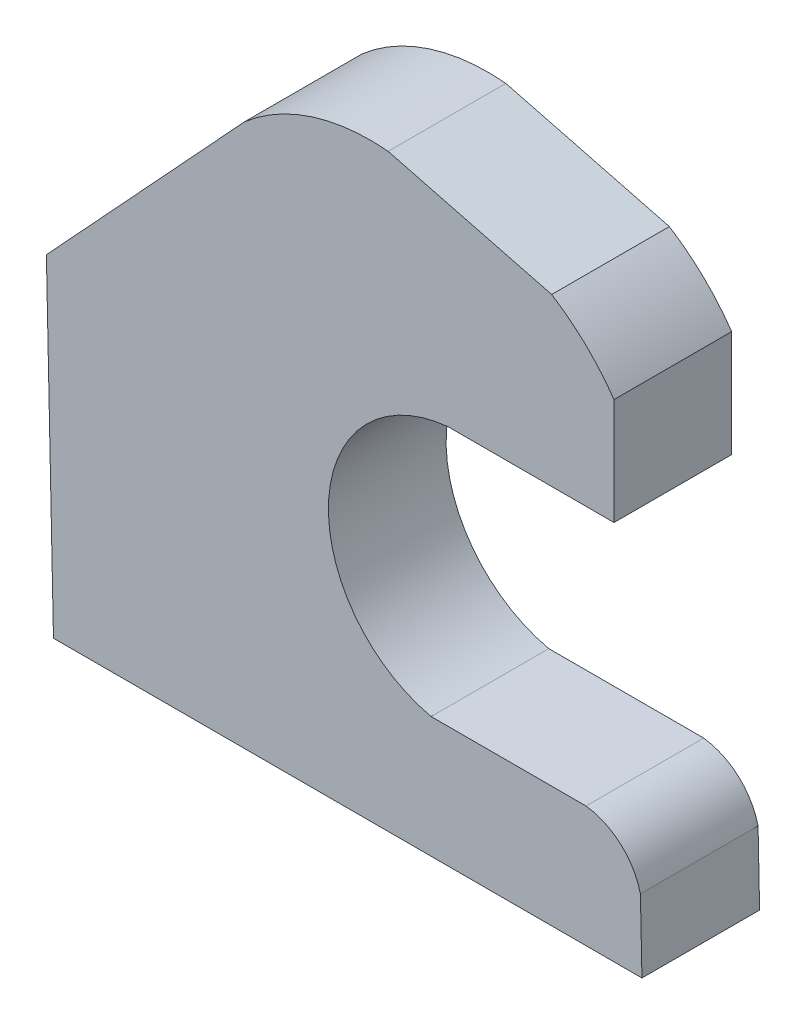
ISO-10303-21;
HEADER;
FILE_DESCRIPTION(('STEP AP214'),'2;1');
FILE_NAME('part.step','',(''),(''),'','','');
FILE_SCHEMA(('AUTOMOTIVE_DESIGN { 1 0 10303 214 1 1 1 1 }'));
ENDSEC;
DATA;
#1=APPLICATION_CONTEXT('core data for automotive mechanical design processes');
#2=APPLICATION_PROTOCOL_DEFINITION('international standard','automotive_design',2000,#1);
#3=PRODUCT_CONTEXT('',#1,'mechanical');
#4=PRODUCT('Part','Part','',(#3));
#5=PRODUCT_RELATED_PRODUCT_CATEGORY('part','',(#4));
#6=PRODUCT_DEFINITION_FORMATION('','',#4);
#7=PRODUCT_DEFINITION_CONTEXT('part definition',#1,'design');
#8=PRODUCT_DEFINITION('design','',#6,#7);
#9=PRODUCT_DEFINITION_SHAPE('','',#8);
#10=(LENGTH_UNIT() NAMED_UNIT(*) SI_UNIT(.MILLI.,.METRE.));
#11=(NAMED_UNIT(*) PLANE_ANGLE_UNIT() SI_UNIT($,.RADIAN.));
#12=(NAMED_UNIT(*) SI_UNIT($,.STERADIAN.) SOLID_ANGLE_UNIT());
#13=UNCERTAINTY_MEASURE_WITH_UNIT(LENGTH_MEASURE(1.E-05),#10,'distance_accuracy_value','');
#14=(GEOMETRIC_REPRESENTATION_CONTEXT(3) GLOBAL_UNCERTAINTY_ASSIGNED_CONTEXT((#13)) GLOBAL_UNIT_ASSIGNED_CONTEXT((#10,
#11,#12)) REPRESENTATION_CONTEXT('',''));
#15=CARTESIAN_POINT('',(0.,0.,0.));
#16=DIRECTION('',(0.,0.,1.));
#17=DIRECTION('',(1.,0.,0.));
#18=AXIS2_PLACEMENT_3D('',#15,#16,#17);
#19=CARTESIAN_POINT('',(458.997671741377,0.215777087943382,50.));
#20=DIRECTION('',(-0.999767174137652,-0.0215777087943382,0.));
#21=DIRECTION('',(0.0215777087943382,-0.999767174137652,0.));
#22=AXIS2_PLACEMENT_3D('',#19,#20,#21);
#23=PLANE('',#22);
#24=DIRECTION('',(-0.0215777087943382,0.999767174137652,0.));
#25=VECTOR('',#24,1.);
#26=CARTESIAN_POINT('',(458.997671741377,0.215777087943382,50.));
#27=LINE('',#26,#25);
#28=CARTESIAN_POINT('',(456.658866876253,108.580402505345,50.));
#29=VERTEX_POINT('',#28);
#30=CARTESIAN_POINT('',(455.997671741376,139.215777087943,50.));
#31=VERTEX_POINT('',#30);
#32=EDGE_CURVE('E110',#29,#31,#27,.T.);
#33=ORIENTED_EDGE('',*,*,#32,.F.);
#34=DIRECTION('',(0.,0.,1.));
#35=VECTOR('',#34,1.);
#36=CARTESIAN_POINT('',(456.658866876253,108.580402505345,0.));
#37=LINE('',#36,#35);
#38=CARTESIAN_POINT('',(456.658866876253,108.580402505345,0.));
#39=VERTEX_POINT('',#38);
#40=EDGE_CURVE('E232',#39,#29,#37,.T.);
#41=ORIENTED_EDGE('',*,*,#40,.F.);
#42=DIRECTION('',(-0.0215777087943382,0.999767174137652,0.));
#43=VECTOR('',#42,1.);
#44=CARTESIAN_POINT('',(458.997671741377,0.215777087943382,0.));
#45=LINE('',#44,#43);
#46=CARTESIAN_POINT('',(455.997671741376,139.215777087943,0.));
#47=VERTEX_POINT('',#46);
#48=EDGE_CURVE('E160',#39,#47,#45,.T.);
#49=ORIENTED_EDGE('',*,*,#48,.T.);
#50=DIRECTION('',(0.,0.,-1.));
#51=VECTOR('',#50,1.);
#52=CARTESIAN_POINT('',(455.997671741376,139.215777087943,50.));
#53=LINE('',#52,#51);
#54=EDGE_CURVE('E11',#31,#47,#53,.T.);
#55=ORIENTED_EDGE('',*,*,#54,.F.);
#56=EDGE_LOOP('',(#33,#41,#49,#55));
#57=FACE_BOUND('',#56,.T.);
#58=ADVANCED_FACE('F43',(#57),#23,.F.);
#59=CARTESIAN_POINT('',(429.438930997848,132.928764738813,50.));
#60=DIRECTION('',(0.,0.,-1.));
#61=DIRECTION('',(-1.,0.,0.));
#62=AXIS2_PLACEMENT_3D('',#59,#60,#61);
#63=CYLINDRICAL_SURFACE('',#62,27.2927322589741);
#64=CARTESIAN_POINT('',(429.438930997848,132.928764738813,0.));
#65=DIRECTION('',(0.,0.,1.));
#66=DIRECTION('',(1.,0.,0.));
#67=AXIS2_PLACEMENT_3D('',#64,#65,#66);
#68=CIRCLE('',#67,27.2927322589741);
#69=CARTESIAN_POINT('',(432.909011053631,160.,0.));
#70=VERTEX_POINT('',#69);
#71=EDGE_CURVE('E162',#47,#70,#68,.T.);
#72=ORIENTED_EDGE('',*,*,#71,.T.);
#73=DIRECTION('',(0.,0.,-1.));
#74=VECTOR('',#73,1.);
#75=CARTESIAN_POINT('',(432.909011053631,160.,50.));
#76=LINE('',#75,#74);
#77=CARTESIAN_POINT('',(432.909011053631,160.,50.));
#78=VERTEX_POINT('',#77);
#79=EDGE_CURVE('E50',#78,#70,#76,.T.);
#80=ORIENTED_EDGE('',*,*,#79,.F.);
#81=CARTESIAN_POINT('',(429.438930997848,132.928764738813,50.));
#82=DIRECTION('',(0.,0.,1.));
#83=DIRECTION('',(1.,0.,0.));
#84=AXIS2_PLACEMENT_3D('',#81,#82,#83);
#85=CIRCLE('',#84,27.2927322589741);
#86=EDGE_CURVE('E223',#31,#78,#85,.T.);
#87=ORIENTED_EDGE('',*,*,#86,.F.);
#88=ORIENTED_EDGE('',*,*,#54,.T.);
#89=EDGE_LOOP('',(#72,#80,#87,#88));
#90=FACE_BOUND('',#89,.T.);
#91=ADVANCED_FACE('F269',(#90),#63,.T.);
#92=CARTESIAN_POINT('',(432.909011053631,160.,50.));
#93=DIRECTION('',(0.,-1.,0.));
#94=DIRECTION('',(0.,0.,-1.));
#95=AXIS2_PLACEMENT_3D('',#92,#93,#94);
#96=PLANE('',#95);
#97=DIRECTION('',(-1.,0.,0.));
#98=VECTOR('',#97,1.);
#99=CARTESIAN_POINT('',(432.909011053631,160.,0.));
#100=LINE('',#99,#98);
#101=CARTESIAN_POINT('',(367.081412811432,160.,0.));
#102=VERTEX_POINT('',#101);
#103=EDGE_CURVE('E165',#70,#102,#100,.T.);
#104=ORIENTED_EDGE('',*,*,#103,.T.);
#105=DIRECTION('',(0.,0.,-1.));
#106=VECTOR('',#105,1.);
#107=CARTESIAN_POINT('',(367.081412811432,160.,50.));
#108=LINE('',#107,#106);
#109=CARTESIAN_POINT('',(367.081412811432,160.,50.));
#110=VERTEX_POINT('',#109);
#111=EDGE_CURVE('E190',#110,#102,#108,.T.);
#112=ORIENTED_EDGE('',*,*,#111,.F.);
#113=DIRECTION('',(-1.,0.,0.));
#114=VECTOR('',#113,1.);
#115=CARTESIAN_POINT('',(432.909011053631,160.,50.));
#116=LINE('',#115,#114);
#117=EDGE_CURVE('E199',#78,#110,#116,.T.);
#118=ORIENTED_EDGE('',*,*,#117,.F.);
#119=ORIENTED_EDGE('',*,*,#79,.T.);
#120=EDGE_LOOP('',(#104,#112,#118,#119));
#121=FACE_BOUND('',#120,.T.);
#122=ADVANCED_FACE('F197',(#121),#96,.F.);
#123=CARTESIAN_POINT('',(379.346158880396,214.556439421034,50.));
#124=DIRECTION('',(0.,0.,-1.));
#125=DIRECTION('',(-1.,0.,0.));
#126=AXIS2_PLACEMENT_3D('',#123,#124,#125);
#127=CYLINDRICAL_SURFACE('',#126,55.918056819217);
#128=CARTESIAN_POINT('',(379.346158880396,214.556439421034,0.));
#129=DIRECTION('',(0.,0.,-1.));
#130=DIRECTION('',(1.,0.,0.));
#131=AXIS2_PLACEMENT_3D('',#128,#129,#130);
#132=CIRCLE('',#131,55.918056819217);
#133=CARTESIAN_POINT('',(374.51374395469,270.265297284241,0.));
#134=VERTEX_POINT('',#133);
#135=EDGE_CURVE('E167',#102,#134,#132,.T.);
#136=ORIENTED_EDGE('',*,*,#135,.T.);
#137=DIRECTION('',(0.,0.,-1.));
#138=VECTOR('',#137,1.);
#139=CARTESIAN_POINT('',(374.51374395469,270.265297284241,50.));
#140=LINE('',#139,#138);
#141=CARTESIAN_POINT('',(374.51374395469,270.265297284241,50.));
#142=VERTEX_POINT('',#141);
#143=EDGE_CURVE('E187',#142,#134,#140,.T.);
#144=ORIENTED_EDGE('',*,*,#143,.F.);
#145=CARTESIAN_POINT('',(379.346158880396,214.556439421034,50.));
#146=DIRECTION('',(0.,0.,-1.));
#147=DIRECTION('',(1.,0.,0.));
#148=AXIS2_PLACEMENT_3D('',#145,#146,#147);
#149=CIRCLE('',#148,55.918056819217);
#150=EDGE_CURVE('E218',#110,#142,#149,.T.);
#151=ORIENTED_EDGE('',*,*,#150,.F.);
#152=ORIENTED_EDGE('',*,*,#111,.T.);
#153=EDGE_LOOP('',(#136,#144,#151,#152));
#154=FACE_BOUND('',#153,.T.);
#155=ADVANCED_FACE('F211',(#154),#127,.F.);
#156=CARTESIAN_POINT('',(434.798113420847,270.265297284241,50.));
#157=DIRECTION('',(0.,1.,0.));
#158=DIRECTION('',(0.,0.,1.));
#159=AXIS2_PLACEMENT_3D('',#156,#157,#158);
#160=PLANE('',#159);
#161=DIRECTION('',(1.,0.,0.));
#162=VECTOR('',#161,1.);
#163=CARTESIAN_POINT('',(434.798113420847,270.265297284241,0.));
#164=LINE('',#163,#162);
#165=CARTESIAN_POINT('',(444.798113420847,270.265297284241,0.));
#166=VERTEX_POINT('',#165);
#167=EDGE_CURVE('E170',#134,#166,#164,.T.);
#168=ORIENTED_EDGE('',*,*,#167,.T.);
#169=DIRECTION('',(0.,0.,-1.));
#170=VECTOR('',#169,1.);
#171=CARTESIAN_POINT('',(444.798113420847,270.265297284241,50.));
#172=LINE('',#171,#170);
#173=CARTESIAN_POINT('',(444.798113420847,270.265297284241,50.));
#174=VERTEX_POINT('',#173);
#175=EDGE_CURVE('E184',#174,#166,#172,.T.);
#176=ORIENTED_EDGE('',*,*,#175,.F.);
#177=DIRECTION('',(1.,0.,0.));
#178=VECTOR('',#177,1.);
#179=CARTESIAN_POINT('',(374.51374395469,270.265297284241,50.));
#180=LINE('',#179,#178);
#181=EDGE_CURVE('E217',#142,#174,#180,.T.);
#182=ORIENTED_EDGE('',*,*,#181,.F.);
#183=ORIENTED_EDGE('',*,*,#143,.T.);
#184=EDGE_LOOP('',(#168,#176,#182,#183));
#185=FACE_BOUND('',#184,.T.);
#186=ADVANCED_FACE('F215',(#185),#160,.F.);
#187=CARTESIAN_POINT('',(444.798113420847,270.265297284241,50.));
#188=DIRECTION('',(-1.,0.,0.));
#189=DIRECTION('',(0.,0.,1.));
#190=AXIS2_PLACEMENT_3D('',#187,#188,#189);
#191=PLANE('',#190);
#192=DIRECTION('',(0.,1.,0.));
#193=VECTOR('',#192,1.);
#194=CARTESIAN_POINT('',(444.798113420847,270.265297284241,0.));
#195=LINE('',#194,#193);
#196=CARTESIAN_POINT('',(444.798113420847,315.516988045478,0.));
#197=VERTEX_POINT('',#196);
#198=EDGE_CURVE('E172',#166,#197,#195,.T.);
#199=ORIENTED_EDGE('',*,*,#198,.T.);
#200=DIRECTION('',(0.,0.,-1.));
#201=VECTOR('',#200,1.);
#202=CARTESIAN_POINT('',(444.798113420847,315.516988045478,50.));
#203=LINE('',#202,#201);
#204=CARTESIAN_POINT('',(444.798113420847,315.516988045478,50.));
#205=VERTEX_POINT('',#204);
#206=EDGE_CURVE('E149',#205,#197,#203,.T.);
#207=ORIENTED_EDGE('',*,*,#206,.F.);
#208=DIRECTION('',(0.,1.,0.));
#209=VECTOR('',#208,1.);
#210=CARTESIAN_POINT('',(444.798113420847,270.265297284241,50.));
#211=LINE('',#210,#209);
#212=EDGE_CURVE('E137',#174,#205,#211,.T.);
#213=ORIENTED_EDGE('',*,*,#212,.F.);
#214=ORIENTED_EDGE('',*,*,#175,.T.);
#215=EDGE_LOOP('',(#199,#207,#213,#214));
#216=FACE_BOUND('',#215,.T.);
#217=ADVANCED_FACE('F282',(#216),#191,.F.);
#218=CARTESIAN_POINT('',(368.736105653195,262.752666833737,50.));
#219=DIRECTION('',(0.,0.,-1.));
#220=DIRECTION('',(-1.,0.,0.));
#221=AXIS2_PLACEMENT_3D('',#218,#219,#220);
#222=CYLINDRICAL_SURFACE('',#221,92.5716080587468);
#223=CARTESIAN_POINT('',(368.736105653195,262.752666833737,0.));
#224=DIRECTION('',(0.,0.,1.));
#225=DIRECTION('',(1.,0.,0.));
#226=AXIS2_PLACEMENT_3D('',#223,#224,#225);
#227=CIRCLE('',#226,92.5716080587468);
#228=CARTESIAN_POINT('',(418.309236409378,340.93199482786,0.));
#229=VERTEX_POINT('',#228);
#230=EDGE_CURVE('E146',#197,#229,#227,.T.);
#231=ORIENTED_EDGE('',*,*,#230,.T.);
#232=DIRECTION('',(0.,0.,-1.));
#233=VECTOR('',#232,1.);
#234=CARTESIAN_POINT('',(418.309236409378,340.93199482786,50.));
#235=LINE('',#234,#233);
#236=CARTESIAN_POINT('',(418.309236409378,340.93199482786,50.));
#237=VERTEX_POINT('',#236);
#238=EDGE_CURVE('E143',#237,#229,#235,.T.);
#239=ORIENTED_EDGE('',*,*,#238,.F.);
#240=CARTESIAN_POINT('',(368.736105653195,262.752666833737,50.));
#241=DIRECTION('',(0.,0.,1.));
#242=DIRECTION('',(1.,0.,0.));
#243=AXIS2_PLACEMENT_3D('',#240,#241,#242);
#244=CIRCLE('',#243,92.5716080587468);
#245=EDGE_CURVE('E129',#205,#237,#244,.T.);
#246=ORIENTED_EDGE('',*,*,#245,.F.);
#247=ORIENTED_EDGE('',*,*,#206,.T.);
#248=EDGE_LOOP('',(#231,#239,#246,#247));
#249=FACE_BOUND('',#248,.T.);
#250=ADVANCED_FACE('F144',(#249),#222,.T.);
#251=CARTESIAN_POINT('',(418.309236409378,340.93199482786,50.));
#252=DIRECTION('',(-0.24987801902177,-0.968277323709358,0.));
#253=DIRECTION('',(0.968277323709358,-0.24987801902177,0.));
#254=AXIS2_PLACEMENT_3D('',#251,#252,#253);
#255=PLANE('',#254);
#256=DIRECTION('',(-0.968277323709358,0.24987801902177,0.));
#257=VECTOR('',#256,1.);
#258=CARTESIAN_POINT('',(418.309236409378,340.93199482786,0.));
#259=LINE('',#258,#257);
#260=CARTESIAN_POINT('',(348.808103311726,358.867771111125,0.));
#261=VERTEX_POINT('',#260);
#262=EDGE_CURVE('E175',#229,#261,#259,.T.);
#263=ORIENTED_EDGE('',*,*,#262,.T.);
#264=DIRECTION('',(0.,0.,-1.));
#265=VECTOR('',#264,1.);
#266=CARTESIAN_POINT('',(348.808103311726,358.867771111125,50.));
#267=LINE('',#266,#265);
#268=CARTESIAN_POINT('',(348.808103311726,358.867771111125,50.));
#269=VERTEX_POINT('',#268);
#270=EDGE_CURVE('E150',#269,#261,#267,.T.);
#271=ORIENTED_EDGE('',*,*,#270,.F.);
#272=DIRECTION('',(-0.968277323709358,0.24987801902177,0.));
#273=VECTOR('',#272,1.);
#274=CARTESIAN_POINT('',(418.309236409378,340.93199482786,50.));
#275=LINE('',#274,#273);
#276=EDGE_CURVE('E134',#237,#269,#275,.T.);
#277=ORIENTED_EDGE('',*,*,#276,.F.);
#278=ORIENTED_EDGE('',*,*,#238,.T.);
#279=EDGE_LOOP('',(#263,#271,#277,#278));
#280=FACE_BOUND('',#279,.T.);
#281=ADVANCED_FACE('F152',(#280),#255,.F.);
#282=CARTESIAN_POINT('',(341.181607074523,277.945602435,50.));
#283=DIRECTION('',(0.,0.,-1.));
#284=DIRECTION('',(-1.,0.,0.));
#285=AXIS2_PLACEMENT_3D('',#282,#283,#284);
#286=CYLINDRICAL_SURFACE('',#285,81.2807531221461);
#287=CARTESIAN_POINT('',(341.181607074523,277.945602435,0.));
#288=DIRECTION('',(0.,0.,1.));
#289=DIRECTION('',(-1.,0.,0.));
#290=AXIS2_PLACEMENT_3D('',#287,#288,#289);
#291=CIRCLE('',#290,81.2807531221461);
#292=CARTESIAN_POINT('',(287.772711056013,339.215910531069,0.));
#293=VERTEX_POINT('',#292);
#294=EDGE_CURVE('E102',#261,#293,#291,.T.);
#295=ORIENTED_EDGE('',*,*,#294,.T.);
#296=DIRECTION('',(0.,0.,-1.));
#297=VECTOR('',#296,1.);
#298=CARTESIAN_POINT('',(287.772711056013,339.215910531069,50.));
#299=LINE('',#298,#297);
#300=CARTESIAN_POINT('',(287.772711056013,339.215910531069,50.));
#301=VERTEX_POINT('',#300);
#302=EDGE_CURVE('E159',#301,#293,#299,.T.);
#303=ORIENTED_EDGE('',*,*,#302,.F.);
#304=CARTESIAN_POINT('',(341.181607074523,277.945602435,50.));
#305=DIRECTION('',(0.,0.,1.));
#306=DIRECTION('',(-1.,0.,0.));
#307=AXIS2_PLACEMENT_3D('',#304,#305,#306);
#308=CIRCLE('',#307,81.2807531221461);
#309=EDGE_CURVE('E66',#269,#301,#308,.T.);
#310=ORIENTED_EDGE('',*,*,#309,.F.);
#311=ORIENTED_EDGE('',*,*,#270,.T.);
#312=EDGE_LOOP('',(#295,#303,#310,#311));
#313=FACE_BOUND('',#312,.T.);
#314=ADVANCED_FACE('F258',(#313),#286,.T.);
#315=CARTESIAN_POINT('',(171.828858078544,213.87929068241,50.));
#316=DIRECTION('',(0.734077602109996,-0.679065588938534,0.));
#317=DIRECTION('',(0.679065588938534,0.734077602109996,0.));
#318=AXIS2_PLACEMENT_3D('',#315,#316,#317);
#319=PLANE('',#318);
#320=DIRECTION('',(-0.679065588938534,-0.734077602109996,0.));
#321=VECTOR('',#320,1.);
#322=CARTESIAN_POINT('',(171.828858078544,213.87929068241,0.));
#323=LINE('',#322,#321);
#324=CARTESIAN_POINT('',(203.587052823287,248.21025933303,0.));
#325=VERTEX_POINT('',#324);
#326=EDGE_CURVE('E178',#293,#325,#323,.T.);
#327=ORIENTED_EDGE('',*,*,#326,.T.);
#328=DIRECTION('',(0.,0.,1.));
#329=VECTOR('',#328,1.);
#330=CARTESIAN_POINT('',(203.587052823287,248.21025933303,0.));
#331=LINE('',#330,#329);
#332=CARTESIAN_POINT('',(203.587052823287,248.21025933303,50.));
#333=VERTEX_POINT('',#332);
#334=EDGE_CURVE('E231',#325,#333,#331,.T.);
#335=ORIENTED_EDGE('',*,*,#334,.T.);
#336=DIRECTION('',(-0.679065588938534,-0.734077602109996,0.));
#337=VECTOR('',#336,1.);
#338=CARTESIAN_POINT('',(171.828858078544,213.87929068241,50.));
#339=LINE('',#338,#337);
#340=EDGE_CURVE('E154',#301,#333,#339,.T.);
#341=ORIENTED_EDGE('',*,*,#340,.F.);
#342=ORIENTED_EDGE('',*,*,#302,.T.);
#343=EDGE_LOOP('',(#327,#335,#341,#342));
#344=FACE_BOUND('',#343,.T.);
#345=ADVANCED_FACE('F257',(#344),#319,.F.);
#346=CARTESIAN_POINT('',(92.6595700148874,270.265297284241,50.));
#347=DIRECTION('',(0.,0.,1.));
#348=DIRECTION('',(1.,0.,0.));
#349=AXIS2_PLACEMENT_3D('',#346,#347,#348);
#350=PLANE('',#349);
#351=DIRECTION('',(-0.0215777087943379,0.999767174137652,0.));
#352=VECTOR('',#351,1.);
#353=CARTESIAN_POINT('',(203.059618877559,272.648032151781,50.));
#354=LINE('',#353,#352);
#355=CARTESIAN_POINT('',(206.600646855539,108.580402505345,50.));
#356=VERTEX_POINT('',#355);
#357=EDGE_CURVE('E163',#356,#333,#354,.T.);
#358=ORIENTED_EDGE('',*,*,#357,.F.);
#359=DIRECTION('',(-1.,0.,0.));
#360=VECTOR('',#359,1.);
#361=CARTESIAN_POINT('',(92.6595700148874,108.580402505345,50.));
#362=LINE('',#361,#360);
#363=EDGE_CURVE('E228',#29,#356,#362,.T.);
#364=ORIENTED_EDGE('',*,*,#363,.F.);
#365=ORIENTED_EDGE('',*,*,#32,.T.);
#366=ORIENTED_EDGE('',*,*,#86,.T.);
#367=ORIENTED_EDGE('',*,*,#117,.T.);
#368=ORIENTED_EDGE('',*,*,#150,.T.);
#369=ORIENTED_EDGE('',*,*,#181,.T.);
#370=ORIENTED_EDGE('',*,*,#212,.T.);
#371=ORIENTED_EDGE('',*,*,#245,.T.);
#372=ORIENTED_EDGE('',*,*,#276,.T.);
#373=ORIENTED_EDGE('',*,*,#309,.T.);
#374=ORIENTED_EDGE('',*,*,#340,.T.);
#375=EDGE_LOOP('',(#358,#364,#365,#366,#367,#368,#369,#370,#371,#372,#373,#374));
#376=FACE_BOUND('',#375,.T.);
#377=ADVANCED_FACE('F132',(#376),#350,.T.);
#378=CARTESIAN_POINT('',(92.6595700148874,270.265297284241,0.));
#379=DIRECTION('',(0.,0.,1.));
#380=DIRECTION('',(1.,0.,0.));
#381=AXIS2_PLACEMENT_3D('',#378,#379,#380);
#382=PLANE('',#381);
#383=DIRECTION('',(-1.,0.,0.));
#384=VECTOR('',#383,1.);
#385=CARTESIAN_POINT('',(0.,108.580402505345,0.));
#386=LINE('',#385,#384);
#387=CARTESIAN_POINT('',(206.600646855539,108.580402505345,0.));
#388=VERTEX_POINT('',#387);
#389=EDGE_CURVE('E240',#39,#388,#386,.T.);
#390=ORIENTED_EDGE('',*,*,#389,.T.);
#391=DIRECTION('',(-0.0215777087943379,0.999767174137652,0.));
#392=VECTOR('',#391,1.);
#393=CARTESIAN_POINT('',(208.846824921914,4.50748542996939,0.));
#394=LINE('',#393,#392);
#395=EDGE_CURVE('E57',#388,#325,#394,.T.);
#396=ORIENTED_EDGE('',*,*,#395,.T.);
#397=ORIENTED_EDGE('',*,*,#326,.F.);
#398=ORIENTED_EDGE('',*,*,#294,.F.);
#399=ORIENTED_EDGE('',*,*,#262,.F.);
#400=ORIENTED_EDGE('',*,*,#230,.F.);
#401=ORIENTED_EDGE('',*,*,#198,.F.);
#402=ORIENTED_EDGE('',*,*,#167,.F.);
#403=ORIENTED_EDGE('',*,*,#135,.F.);
#404=ORIENTED_EDGE('',*,*,#103,.F.);
#405=ORIENTED_EDGE('',*,*,#71,.F.);
#406=ORIENTED_EDGE('',*,*,#48,.F.);
#407=EDGE_LOOP('',(#390,#396,#397,#398,#399,#400,#401,#402,#403,#404,#405,#406));
#408=FACE_BOUND('',#407,.T.);
#409=ADVANCED_FACE('F206',(#408),#382,.F.);
#410=CARTESIAN_POINT('',(208.846824921914,4.50748542996939,0.));
#411=DIRECTION('',(0.999767174137652,0.0215777087943379,0.));
#412=DIRECTION('',(-0.0215777087943379,0.999767174137652,0.));
#413=AXIS2_PLACEMENT_3D('',#410,#411,#412);
#414=PLANE('',#413);
#415=ORIENTED_EDGE('',*,*,#357,.T.);
#416=ORIENTED_EDGE('',*,*,#334,.F.);
#417=ORIENTED_EDGE('',*,*,#395,.F.);
#418=DIRECTION('',(0.,0.,1.));
#419=VECTOR('',#418,1.);
#420=CARTESIAN_POINT('',(206.600646855539,108.580402505345,0.));
#421=LINE('',#420,#419);
#422=EDGE_CURVE('E235',#388,#356,#421,.T.);
#423=ORIENTED_EDGE('',*,*,#422,.T.);
#424=EDGE_LOOP('',(#415,#416,#417,#423));
#425=FACE_BOUND('',#424,.T.);
#426=ADVANCED_FACE('F254',(#425),#414,.F.);
#427=CARTESIAN_POINT('',(0.,108.580402505345,0.));
#428=DIRECTION('',(0.,1.,0.));
#429=DIRECTION('',(-1.,0.,0.));
#430=AXIS2_PLACEMENT_3D('',#427,#428,#429);
#431=PLANE('',#430);
#432=ORIENTED_EDGE('',*,*,#363,.T.);
#433=ORIENTED_EDGE('',*,*,#422,.F.);
#434=ORIENTED_EDGE('',*,*,#389,.F.);
#435=ORIENTED_EDGE('',*,*,#40,.T.);
#436=EDGE_LOOP('',(#432,#433,#434,#435));
#437=FACE_BOUND('',#436,.T.);
#438=ADVANCED_FACE('F247',(#437),#431,.F.);
#439=CLOSED_SHELL('',(#58,#91,#122,#155,#186,#217,#250,#281,#314,#345,#377,#409,#426,#438));
#440=MANIFOLD_SOLID_BREP('B2',#439);
#441=ADVANCED_BREP_SHAPE_REPRESENTATION('',(#18,#440),#14);
#442=SHAPE_DEFINITION_REPRESENTATION(#9,#441);
ENDSEC;
END-ISO-10303-21;
